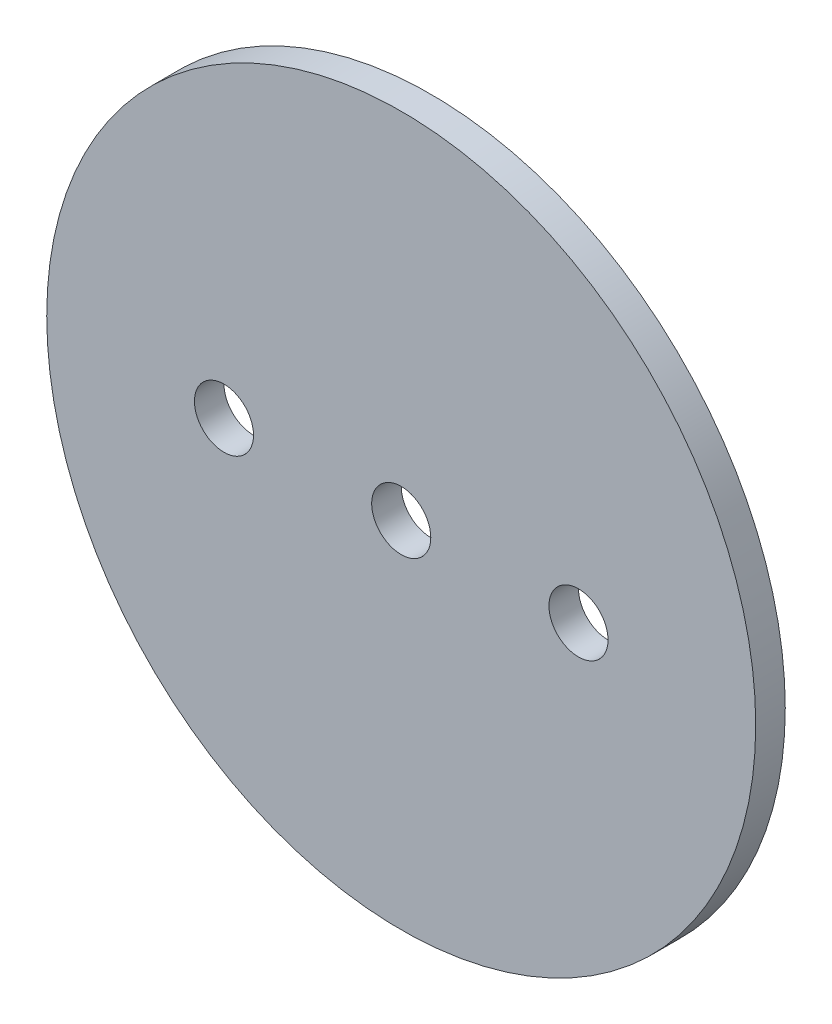
ISO-10303-21;
HEADER;
FILE_DESCRIPTION(('STEP AP214'),'2;1');
FILE_NAME('part.step','',(''),(''),'','','');
FILE_SCHEMA(('AUTOMOTIVE_DESIGN { 1 0 10303 214 1 1 1 1 }'));
ENDSEC;
DATA;
#1=APPLICATION_CONTEXT('core data for automotive mechanical design processes');
#2=APPLICATION_PROTOCOL_DEFINITION('international standard','automotive_design',2000,#1);
#3=PRODUCT_CONTEXT('',#1,'mechanical');
#4=PRODUCT('Part','Part','',(#3));
#5=PRODUCT_RELATED_PRODUCT_CATEGORY('part','',(#4));
#6=PRODUCT_DEFINITION_FORMATION('','',#4);
#7=PRODUCT_DEFINITION_CONTEXT('part definition',#1,'design');
#8=PRODUCT_DEFINITION('design','',#6,#7);
#9=PRODUCT_DEFINITION_SHAPE('','',#8);
#10=(LENGTH_UNIT() NAMED_UNIT(*) SI_UNIT(.MILLI.,.METRE.));
#11=(NAMED_UNIT(*) PLANE_ANGLE_UNIT() SI_UNIT($,.RADIAN.));
#12=(NAMED_UNIT(*) SI_UNIT($,.STERADIAN.) SOLID_ANGLE_UNIT());
#13=UNCERTAINTY_MEASURE_WITH_UNIT(LENGTH_MEASURE(1.E-05),#10,'distance_accuracy_value','');
#14=(GEOMETRIC_REPRESENTATION_CONTEXT(3) GLOBAL_UNCERTAINTY_ASSIGNED_CONTEXT((#13)) GLOBAL_UNIT_ASSIGNED_CONTEXT((#10,
#11,#12)) REPRESENTATION_CONTEXT('',''));
#15=CARTESIAN_POINT('',(0.,0.,0.));
#16=DIRECTION('',(0.,0.,1.));
#17=DIRECTION('',(1.,0.,0.));
#18=AXIS2_PLACEMENT_3D('',#15,#16,#17);
#19=CARTESIAN_POINT('',(0.,0.,1.5875));
#20=DIRECTION('',(0.,0.,-1.));
#21=DIRECTION('',(-1.,0.,0.));
#22=AXIS2_PLACEMENT_3D('',#19,#20,#21);
#23=CYLINDRICAL_SURFACE('',#22,38.1);
#24=CARTESIAN_POINT('',(0.,0.,1.5875));
#25=DIRECTION('',(0.,0.,1.));
#26=DIRECTION('',(1.,0.,0.));
#27=AXIS2_PLACEMENT_3D('',#24,#25,#26);
#28=CIRCLE('',#27,38.1);
#29=CARTESIAN_POINT('',(38.1,0.,1.5875));
#30=VERTEX_POINT('',#29);
#31=EDGE_CURVE('E10',#30,#30,#28,.T.);
#32=ORIENTED_EDGE('',*,*,#31,.F.);
#33=EDGE_LOOP('',(#32));
#34=FACE_BOUND('',#33,.T.);
#35=CARTESIAN_POINT('',(0.,0.,-1.5875));
#36=DIRECTION('',(0.,0.,1.));
#37=DIRECTION('',(1.,0.,0.));
#38=AXIS2_PLACEMENT_3D('',#35,#36,#37);
#39=CIRCLE('',#38,38.1);
#40=CARTESIAN_POINT('',(38.1,0.,-1.5875));
#41=VERTEX_POINT('',#40);
#42=EDGE_CURVE('E40',#41,#41,#39,.T.);
#43=ORIENTED_EDGE('',*,*,#42,.T.);
#44=EDGE_LOOP('',(#43));
#45=FACE_BOUND('',#44,.T.);
#46=ADVANCED_FACE('F37',(#34,#45),#23,.T.);
#47=CARTESIAN_POINT('',(0.,0.,1.5875));
#48=DIRECTION('',(0.,0.,1.));
#49=DIRECTION('',(1.,0.,0.));
#50=AXIS2_PLACEMENT_3D('',#47,#48,#49);
#51=PLANE('',#50);
#52=CARTESIAN_POINT('',(0.,0.,1.5875));
#53=DIRECTION('',(0.,0.,1.));
#54=DIRECTION('',(1.,0.,0.));
#55=AXIS2_PLACEMENT_3D('',#52,#53,#54);
#56=CIRCLE('',#55,3.17499999999999);
#57=CARTESIAN_POINT('',(3.17499999999999,0.,1.5875));
#58=VERTEX_POINT('',#57);
#59=EDGE_CURVE('E63',#58,#58,#56,.T.);
#60=ORIENTED_EDGE('',*,*,#59,.F.);
#61=EDGE_LOOP('',(#60));
#62=FACE_BOUND('',#61,.T.);
#63=CARTESIAN_POINT('',(19.05,0.,1.5875));
#64=DIRECTION('',(0.,0.,1.));
#65=DIRECTION('',(1.,0.,0.));
#66=AXIS2_PLACEMENT_3D('',#63,#64,#65);
#67=CIRCLE('',#66,3.17499999999999);
#68=CARTESIAN_POINT('',(22.225,0.,1.5875));
#69=VERTEX_POINT('',#68);
#70=EDGE_CURVE('E57',#69,#69,#67,.T.);
#71=ORIENTED_EDGE('',*,*,#70,.F.);
#72=EDGE_LOOP('',(#71));
#73=FACE_BOUND('',#72,.T.);
#74=CARTESIAN_POINT('',(-19.05,0.,1.5875));
#75=DIRECTION('',(0.,0.,1.));
#76=DIRECTION('',(1.,0.,0.));
#77=AXIS2_PLACEMENT_3D('',#74,#75,#76);
#78=CIRCLE('',#77,3.17499999999999);
#79=CARTESIAN_POINT('',(-15.875,0.,1.5875));
#80=VERTEX_POINT('',#79);
#81=EDGE_CURVE('E51',#80,#80,#78,.T.);
#82=ORIENTED_EDGE('',*,*,#81,.F.);
#83=EDGE_LOOP('',(#82));
#84=FACE_BOUND('',#83,.T.);
#85=ORIENTED_EDGE('',*,*,#31,.T.);
#86=EDGE_LOOP('',(#85));
#87=FACE_BOUND('',#86,.T.);
#88=ADVANCED_FACE('F69',(#62,#73,#84,#87),#51,.T.);
#89=CARTESIAN_POINT('',(0.,0.,-1.5875));
#90=DIRECTION('',(0.,0.,1.));
#91=DIRECTION('',(1.,0.,0.));
#92=AXIS2_PLACEMENT_3D('',#89,#90,#91);
#93=PLANE('',#92);
#94=CARTESIAN_POINT('',(0.,0.,-1.5875));
#95=DIRECTION('',(0.,0.,1.));
#96=DIRECTION('',(1.,0.,0.));
#97=AXIS2_PLACEMENT_3D('',#94,#95,#96);
#98=CIRCLE('',#97,3.17499999999999);
#99=CARTESIAN_POINT('',(3.17499999999999,0.,-1.5875));
#100=VERTEX_POINT('',#99);
#101=EDGE_CURVE('E60',#100,#100,#98,.T.);
#102=ORIENTED_EDGE('',*,*,#101,.T.);
#103=EDGE_LOOP('',(#102));
#104=FACE_BOUND('',#103,.T.);
#105=CARTESIAN_POINT('',(19.05,0.,-1.5875));
#106=DIRECTION('',(0.,0.,1.));
#107=DIRECTION('',(1.,0.,0.));
#108=AXIS2_PLACEMENT_3D('',#105,#106,#107);
#109=CIRCLE('',#108,3.17499999999999);
#110=CARTESIAN_POINT('',(22.225,0.,-1.5875));
#111=VERTEX_POINT('',#110);
#112=EDGE_CURVE('E54',#111,#111,#109,.T.);
#113=ORIENTED_EDGE('',*,*,#112,.T.);
#114=EDGE_LOOP('',(#113));
#115=FACE_BOUND('',#114,.T.);
#116=CARTESIAN_POINT('',(-19.05,0.,-1.5875));
#117=DIRECTION('',(0.,0.,1.));
#118=DIRECTION('',(1.,0.,0.));
#119=AXIS2_PLACEMENT_3D('',#116,#117,#118);
#120=CIRCLE('',#119,3.17499999999999);
#121=CARTESIAN_POINT('',(-15.875,0.,-1.5875));
#122=VERTEX_POINT('',#121);
#123=EDGE_CURVE('E47',#122,#122,#120,.T.);
#124=ORIENTED_EDGE('',*,*,#123,.T.);
#125=EDGE_LOOP('',(#124));
#126=FACE_BOUND('',#125,.T.);
#127=ORIENTED_EDGE('',*,*,#42,.F.);
#128=EDGE_LOOP('',(#127));
#129=FACE_BOUND('',#128,.T.);
#130=ADVANCED_FACE('F72',(#104,#115,#126,#129),#93,.F.);
#131=CARTESIAN_POINT('',(-19.05,0.,1.5875));
#132=DIRECTION('',(0.,0.,1.));
#133=DIRECTION('',(1.,0.,0.));
#134=AXIS2_PLACEMENT_3D('',#131,#132,#133);
#135=CYLINDRICAL_SURFACE('',#134,3.17499999999999);
#136=ORIENTED_EDGE('',*,*,#123,.F.);
#137=EDGE_LOOP('',(#136));
#138=FACE_BOUND('',#137,.T.);
#139=ORIENTED_EDGE('',*,*,#81,.T.);
#140=EDGE_LOOP('',(#139));
#141=FACE_BOUND('',#140,.T.);
#142=ADVANCED_FACE('F78',(#138,#141),#135,.F.);
#143=CARTESIAN_POINT('',(19.05,0.,1.5875));
#144=DIRECTION('',(0.,0.,1.));
#145=DIRECTION('',(1.,0.,0.));
#146=AXIS2_PLACEMENT_3D('',#143,#144,#145);
#147=CYLINDRICAL_SURFACE('',#146,3.17499999999999);
#148=ORIENTED_EDGE('',*,*,#112,.F.);
#149=EDGE_LOOP('',(#148));
#150=FACE_BOUND('',#149,.T.);
#151=ORIENTED_EDGE('',*,*,#70,.T.);
#152=EDGE_LOOP('',(#151));
#153=FACE_BOUND('',#152,.T.);
#154=ADVANCED_FACE('F80',(#150,#153),#147,.F.);
#155=CARTESIAN_POINT('',(0.,0.,1.5875));
#156=DIRECTION('',(0.,0.,1.));
#157=DIRECTION('',(1.,0.,0.));
#158=AXIS2_PLACEMENT_3D('',#155,#156,#157);
#159=CYLINDRICAL_SURFACE('',#158,3.17499999999999);
#160=ORIENTED_EDGE('',*,*,#101,.F.);
#161=EDGE_LOOP('',(#160));
#162=FACE_BOUND('',#161,.T.);
#163=ORIENTED_EDGE('',*,*,#59,.T.);
#164=EDGE_LOOP('',(#163));
#165=FACE_BOUND('',#164,.T.);
#166=ADVANCED_FACE('F67',(#162,#165),#159,.F.);
#167=CLOSED_SHELL('',(#46,#88,#130,#142,#154,#166));
#168=MANIFOLD_SOLID_BREP('B2',#167);
#169=ADVANCED_BREP_SHAPE_REPRESENTATION('',(#18,#168),#14);
#170=SHAPE_DEFINITION_REPRESENTATION(#9,#169);
ENDSEC;
END-ISO-10303-21;
